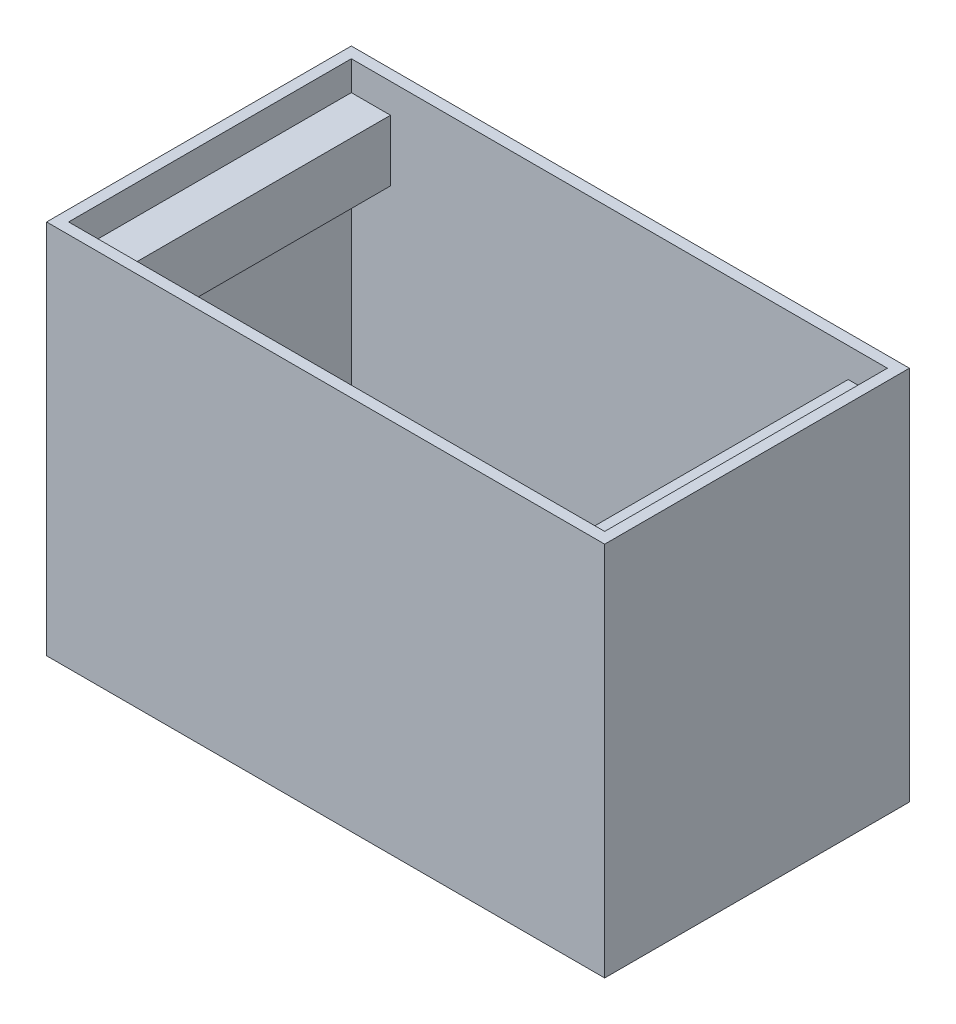
ISO-10303-21;
HEADER;
FILE_DESCRIPTION(('STEP AP214'),'2;1');
FILE_NAME('part.step','',(''),(''),'','','');
FILE_SCHEMA(('AUTOMOTIVE_DESIGN { 1 0 10303 214 1 1 1 1 }'));
ENDSEC;
DATA;
#1=APPLICATION_CONTEXT('core data for automotive mechanical design processes');
#2=APPLICATION_PROTOCOL_DEFINITION('international standard','automotive_design',2000,#1);
#3=PRODUCT_CONTEXT('',#1,'mechanical');
#4=PRODUCT('Part','Part','',(#3));
#5=PRODUCT_RELATED_PRODUCT_CATEGORY('part','',(#4));
#6=PRODUCT_DEFINITION_FORMATION('','',#4);
#7=PRODUCT_DEFINITION_CONTEXT('part definition',#1,'design');
#8=PRODUCT_DEFINITION('design','',#6,#7);
#9=PRODUCT_DEFINITION_SHAPE('','',#8);
#10=(LENGTH_UNIT() NAMED_UNIT(*) SI_UNIT(.MILLI.,.METRE.));
#11=(NAMED_UNIT(*) PLANE_ANGLE_UNIT() SI_UNIT($,.RADIAN.));
#12=(NAMED_UNIT(*) SI_UNIT($,.STERADIAN.) SOLID_ANGLE_UNIT());
#13=UNCERTAINTY_MEASURE_WITH_UNIT(LENGTH_MEASURE(1.E-05),#10,'distance_accuracy_value','');
#14=(GEOMETRIC_REPRESENTATION_CONTEXT(3) GLOBAL_UNCERTAINTY_ASSIGNED_CONTEXT((#13)) GLOBAL_UNIT_ASSIGNED_CONTEXT((#10,
#11,#12)) REPRESENTATION_CONTEXT('',''));
#15=CARTESIAN_POINT('',(0.,0.,0.));
#16=DIRECTION('',(0.,0.,1.));
#17=DIRECTION('',(1.,0.,0.));
#18=AXIS2_PLACEMENT_3D('',#15,#16,#17);
#19=CARTESIAN_POINT('',(219.,298.,115.5));
#20=DIRECTION('',(-1.,0.,0.));
#21=DIRECTION('',(0.,0.,1.));
#22=AXIS2_PLACEMENT_3D('',#19,#20,#21);
#23=PLANE('',#22);
#24=DIRECTION('',(0.,0.,-1.));
#25=VECTOR('',#24,1.);
#26=CARTESIAN_POINT('',(219.,224.,115.5));
#27=LINE('',#26,#25);
#28=CARTESIAN_POINT('',(219.,224.,115.5));
#29=VERTEX_POINT('',#28);
#30=CARTESIAN_POINT('',(219.,224.,-115.5));
#31=VERTEX_POINT('',#30);
#32=EDGE_CURVE('E178',#29,#31,#27,.T.);
#33=ORIENTED_EDGE('',*,*,#32,.T.);
#34=DIRECTION('',(0.,-1.,0.));
#35=VECTOR('',#34,1.);
#36=CARTESIAN_POINT('',(219.,298.,-115.5));
#37=LINE('',#36,#35);
#38=CARTESIAN_POINT('',(219.,0.,-115.5));
#39=VERTEX_POINT('',#38);
#40=EDGE_CURVE('E166',#31,#39,#37,.T.);
#41=ORIENTED_EDGE('',*,*,#40,.T.);
#42=DIRECTION('',(0.,0.,-1.));
#43=VECTOR('',#42,1.);
#44=CARTESIAN_POINT('',(219.,0.,115.5));
#45=LINE('',#44,#43);
#46=CARTESIAN_POINT('',(219.,0.,115.5));
#47=VERTEX_POINT('',#46);
#48=EDGE_CURVE('E213',#47,#39,#45,.T.);
#49=ORIENTED_EDGE('',*,*,#48,.F.);
#50=DIRECTION('',(0.,-1.,0.));
#51=VECTOR('',#50,1.);
#52=CARTESIAN_POINT('',(219.,298.,115.5));
#53=LINE('',#52,#51);
#54=EDGE_CURVE('E223',#29,#47,#53,.T.);
#55=ORIENTED_EDGE('',*,*,#54,.F.);
#56=EDGE_LOOP('',(#33,#41,#49,#55));
#57=FACE_BOUND('',#56,.T.);
#58=ADVANCED_FACE('F43',(#57),#23,.T.);
#59=CARTESIAN_POINT('',(-219.,298.,-115.5));
#60=DIRECTION('',(0.,0.,1.));
#61=DIRECTION('',(1.,0.,0.));
#62=AXIS2_PLACEMENT_3D('',#59,#60,#61);
#63=PLANE('',#62);
#64=DIRECTION('',(1.,0.,0.));
#65=VECTOR('',#64,1.);
#66=CARTESIAN_POINT('',(187.,224.,-115.5));
#67=LINE('',#66,#65);
#68=CARTESIAN_POINT('',(187.,224.,-115.5));
#69=VERTEX_POINT('',#68);
#70=EDGE_CURVE('E65',#69,#31,#67,.T.);
#71=ORIENTED_EDGE('',*,*,#70,.F.);
#72=DIRECTION('',(0.,1.,0.));
#73=VECTOR('',#72,1.);
#74=CARTESIAN_POINT('',(187.,224.,-115.5));
#75=LINE('',#74,#73);
#76=CARTESIAN_POINT('',(187.,274.,-115.5));
#77=VERTEX_POINT('',#76);
#78=EDGE_CURVE('E60',#69,#77,#75,.T.);
#79=ORIENTED_EDGE('',*,*,#78,.T.);
#80=DIRECTION('',(1.,0.,0.));
#81=VECTOR('',#80,1.);
#82=CARTESIAN_POINT('',(187.,274.,-115.5));
#83=LINE('',#82,#81);
#84=CARTESIAN_POINT('',(219.,274.,-115.5));
#85=VERTEX_POINT('',#84);
#86=EDGE_CURVE('E168',#77,#85,#83,.T.);
#87=ORIENTED_EDGE('',*,*,#86,.T.);
#88=CARTESIAN_POINT('',(219.,298.,-115.5));
#89=VERTEX_POINT('',#88);
#90=EDGE_CURVE('E156',#89,#85,#37,.T.);
#91=ORIENTED_EDGE('',*,*,#90,.F.);
#92=DIRECTION('',(-1.,0.,0.));
#93=VECTOR('',#92,1.);
#94=CARTESIAN_POINT('',(-219.,298.,-115.5));
#95=LINE('',#94,#93);
#96=CARTESIAN_POINT('',(-219.,298.,-115.5));
#97=VERTEX_POINT('',#96);
#98=EDGE_CURVE('E215',#89,#97,#95,.T.);
#99=ORIENTED_EDGE('',*,*,#98,.T.);
#100=DIRECTION('',(0.,-1.,0.));
#101=VECTOR('',#100,1.);
#102=CARTESIAN_POINT('',(-219.,298.,-115.5));
#103=LINE('',#102,#101);
#104=CARTESIAN_POINT('',(-219.,274.,-115.5));
#105=VERTEX_POINT('',#104);
#106=EDGE_CURVE('E241',#97,#105,#103,.T.);
#107=ORIENTED_EDGE('',*,*,#106,.T.);
#108=DIRECTION('',(-1.,0.,0.));
#109=VECTOR('',#108,1.);
#110=CARTESIAN_POINT('',(-187.,274.,-115.5));
#111=LINE('',#110,#109);
#112=CARTESIAN_POINT('',(-187.,274.,-115.5));
#113=VERTEX_POINT('',#112);
#114=EDGE_CURVE('E211',#113,#105,#111,.T.);
#115=ORIENTED_EDGE('',*,*,#114,.F.);
#116=DIRECTION('',(0.,1.,0.));
#117=VECTOR('',#116,1.);
#118=CARTESIAN_POINT('',(-187.,224.,-115.5));
#119=LINE('',#118,#117);
#120=CARTESIAN_POINT('',(-187.,224.,-115.5));
#121=VERTEX_POINT('',#120);
#122=EDGE_CURVE('E190',#121,#113,#119,.T.);
#123=ORIENTED_EDGE('',*,*,#122,.F.);
#124=DIRECTION('',(-1.,0.,0.));
#125=VECTOR('',#124,1.);
#126=CARTESIAN_POINT('',(-187.,224.,-115.5));
#127=LINE('',#126,#125);
#128=CARTESIAN_POINT('',(-219.,224.,-115.5));
#129=VERTEX_POINT('',#128);
#130=EDGE_CURVE('E201',#121,#129,#127,.T.);
#131=ORIENTED_EDGE('',*,*,#130,.T.);
#132=CARTESIAN_POINT('',(-219.,0.,-115.5));
#133=VERTEX_POINT('',#132);
#134=EDGE_CURVE('E240',#129,#133,#103,.T.);
#135=ORIENTED_EDGE('',*,*,#134,.T.);
#136=DIRECTION('',(-1.,0.,0.));
#137=VECTOR('',#136,1.);
#138=CARTESIAN_POINT('',(-219.,0.,-115.5));
#139=LINE('',#138,#137);
#140=EDGE_CURVE('E226',#39,#133,#139,.T.);
#141=ORIENTED_EDGE('',*,*,#140,.F.);
#142=ORIENTED_EDGE('',*,*,#40,.F.);
#143=EDGE_LOOP('',(#71,#79,#87,#91,#99,#107,#115,#123,#131,#135,#141,#142));
#144=FACE_BOUND('',#143,.T.);
#145=ADVANCED_FACE('F169',(#144),#63,.T.);
#146=CARTESIAN_POINT('',(-219.,298.,115.5));
#147=DIRECTION('',(1.,0.,0.));
#148=DIRECTION('',(0.,0.,-1.));
#149=AXIS2_PLACEMENT_3D('',#146,#147,#148);
#150=PLANE('',#149);
#151=DIRECTION('',(0.,-1.,0.));
#152=VECTOR('',#151,1.);
#153=CARTESIAN_POINT('',(-219.,298.,115.5));
#154=LINE('',#153,#152);
#155=CARTESIAN_POINT('',(-219.,298.,115.5));
#156=VERTEX_POINT('',#155);
#157=CARTESIAN_POINT('',(-219.,274.,115.5));
#158=VERTEX_POINT('',#157);
#159=EDGE_CURVE('E237',#156,#158,#154,.T.);
#160=ORIENTED_EDGE('',*,*,#159,.T.);
#161=DIRECTION('',(0.,0.,1.));
#162=VECTOR('',#161,1.);
#163=CARTESIAN_POINT('',(-219.,274.,115.5));
#164=LINE('',#163,#162);
#165=EDGE_CURVE('E189',#105,#158,#164,.T.);
#166=ORIENTED_EDGE('',*,*,#165,.F.);
#167=ORIENTED_EDGE('',*,*,#106,.F.);
#168=DIRECTION('',(0.,0.,1.));
#169=VECTOR('',#168,1.);
#170=CARTESIAN_POINT('',(-219.,298.,115.5));
#171=LINE('',#170,#169);
#172=EDGE_CURVE('E218',#97,#156,#171,.T.);
#173=ORIENTED_EDGE('',*,*,#172,.T.);
#174=EDGE_LOOP('',(#160,#166,#167,#173));
#175=FACE_BOUND('',#174,.T.);
#176=ADVANCED_FACE('F298',(#175),#150,.T.);
#177=ORIENTED_EDGE('',*,*,#134,.F.);
#178=DIRECTION('',(0.,0.,-1.));
#179=VECTOR('',#178,1.);
#180=CARTESIAN_POINT('',(-219.,224.,115.5));
#181=LINE('',#180,#179);
#182=CARTESIAN_POINT('',(-219.,224.,115.5));
#183=VERTEX_POINT('',#182);
#184=EDGE_CURVE('E194',#183,#129,#181,.T.);
#185=ORIENTED_EDGE('',*,*,#184,.F.);
#186=CARTESIAN_POINT('',(-219.,0.,115.5));
#187=VERTEX_POINT('',#186);
#188=EDGE_CURVE('E236',#183,#187,#154,.T.);
#189=ORIENTED_EDGE('',*,*,#188,.T.);
#190=DIRECTION('',(0.,0.,1.));
#191=VECTOR('',#190,1.);
#192=CARTESIAN_POINT('',(-219.,0.,115.5));
#193=LINE('',#192,#191);
#194=EDGE_CURVE('E229',#133,#187,#193,.T.);
#195=ORIENTED_EDGE('',*,*,#194,.F.);
#196=EDGE_LOOP('',(#177,#185,#189,#195));
#197=FACE_BOUND('',#196,.T.);
#198=ADVANCED_FACE('F324',(#197),#150,.T.);
#199=CARTESIAN_POINT('',(-219.,298.,115.5));
#200=DIRECTION('',(0.,0.,-1.));
#201=DIRECTION('',(-1.,0.,0.));
#202=AXIS2_PLACEMENT_3D('',#199,#200,#201);
#203=PLANE('',#202);
#204=DIRECTION('',(1.,0.,0.));
#205=VECTOR('',#204,1.);
#206=CARTESIAN_POINT('',(187.,224.,115.5));
#207=LINE('',#206,#205);
#208=CARTESIAN_POINT('',(187.,224.,115.5));
#209=VERTEX_POINT('',#208);
#210=EDGE_CURVE('E186',#209,#29,#207,.T.);
#211=ORIENTED_EDGE('',*,*,#210,.T.);
#212=ORIENTED_EDGE('',*,*,#54,.T.);
#213=DIRECTION('',(1.,0.,0.));
#214=VECTOR('',#213,1.);
#215=CARTESIAN_POINT('',(-219.,0.,115.5));
#216=LINE('',#215,#214);
#217=EDGE_CURVE('E216',#187,#47,#216,.T.);
#218=ORIENTED_EDGE('',*,*,#217,.F.);
#219=ORIENTED_EDGE('',*,*,#188,.F.);
#220=DIRECTION('',(-1.,0.,0.));
#221=VECTOR('',#220,1.);
#222=CARTESIAN_POINT('',(-187.,224.,115.5));
#223=LINE('',#222,#221);
#224=CARTESIAN_POINT('',(-187.,224.,115.5));
#225=VERTEX_POINT('',#224);
#226=EDGE_CURVE('E206',#225,#183,#223,.T.);
#227=ORIENTED_EDGE('',*,*,#226,.F.);
#228=DIRECTION('',(0.,-1.,0.));
#229=VECTOR('',#228,1.);
#230=CARTESIAN_POINT('',(-187.,224.,115.5));
#231=LINE('',#230,#229);
#232=CARTESIAN_POINT('',(-187.,274.,115.5));
#233=VERTEX_POINT('',#232);
#234=EDGE_CURVE('E197',#233,#225,#231,.T.);
#235=ORIENTED_EDGE('',*,*,#234,.F.);
#236=DIRECTION('',(-1.,0.,0.));
#237=VECTOR('',#236,1.);
#238=CARTESIAN_POINT('',(-187.,274.,115.5));
#239=LINE('',#238,#237);
#240=EDGE_CURVE('E208',#233,#158,#239,.T.);
#241=ORIENTED_EDGE('',*,*,#240,.T.);
#242=ORIENTED_EDGE('',*,*,#159,.F.);
#243=DIRECTION('',(1.,0.,0.));
#244=VECTOR('',#243,1.);
#245=CARTESIAN_POINT('',(-219.,298.,115.5));
#246=LINE('',#245,#244);
#247=CARTESIAN_POINT('',(219.,298.,115.5));
#248=VERTEX_POINT('',#247);
#249=EDGE_CURVE('E221',#156,#248,#246,.T.);
#250=ORIENTED_EDGE('',*,*,#249,.T.);
#251=CARTESIAN_POINT('',(219.,274.,115.5));
#252=VERTEX_POINT('',#251);
#253=EDGE_CURVE('E234',#248,#252,#53,.T.);
#254=ORIENTED_EDGE('',*,*,#253,.T.);
#255=DIRECTION('',(1.,0.,0.));
#256=VECTOR('',#255,1.);
#257=CARTESIAN_POINT('',(187.,274.,115.5));
#258=LINE('',#257,#256);
#259=CARTESIAN_POINT('',(187.,274.,115.5));
#260=VERTEX_POINT('',#259);
#261=EDGE_CURVE('E173',#260,#252,#258,.T.);
#262=ORIENTED_EDGE('',*,*,#261,.F.);
#263=DIRECTION('',(0.,-1.,0.));
#264=VECTOR('',#263,1.);
#265=CARTESIAN_POINT('',(187.,224.,115.5));
#266=LINE('',#265,#264);
#267=EDGE_CURVE('E368',#260,#209,#266,.T.);
#268=ORIENTED_EDGE('',*,*,#267,.T.);
#269=EDGE_LOOP('',(#211,#212,#218,#219,#227,#235,#241,#242,#250,#254,#262,#268));
#270=FACE_BOUND('',#269,.T.);
#271=ADVANCED_FACE('F318',(#270),#203,.T.);
#272=CARTESIAN_POINT('',(-228.,-8.99999999999993,0.));
#273=DIRECTION('',(1.,0.,0.));
#274=DIRECTION('',(0.,0.,-1.));
#275=AXIS2_PLACEMENT_3D('',#272,#273,#274);
#276=PLANE('',#275);
#277=DIRECTION('',(0.,1.,0.));
#278=VECTOR('',#277,1.);
#279=CARTESIAN_POINT('',(-228.,-8.99999999999993,124.5));
#280=LINE('',#279,#278);
#281=CARTESIAN_POINT('',(-228.,-8.99999999999993,124.5));
#282=VERTEX_POINT('',#281);
#283=CARTESIAN_POINT('',(-228.,298.,124.5));
#284=VERTEX_POINT('',#283);
#285=EDGE_CURVE('E47',#282,#284,#280,.T.);
#286=ORIENTED_EDGE('',*,*,#285,.T.);
#287=DIRECTION('',(0.,0.,1.));
#288=VECTOR('',#287,1.);
#289=CARTESIAN_POINT('',(-228.,298.,124.5));
#290=LINE('',#289,#288);
#291=CARTESIAN_POINT('',(-228.,298.,-124.5));
#292=VERTEX_POINT('',#291);
#293=EDGE_CURVE('E252',#292,#284,#290,.T.);
#294=ORIENTED_EDGE('',*,*,#293,.F.);
#295=DIRECTION('',(0.,1.,0.));
#296=VECTOR('',#295,1.);
#297=CARTESIAN_POINT('',(-228.,-8.99999999999993,-124.5));
#298=LINE('',#297,#296);
#299=CARTESIAN_POINT('',(-228.,-8.99999999999993,-124.5));
#300=VERTEX_POINT('',#299);
#301=EDGE_CURVE('E11',#300,#292,#298,.T.);
#302=ORIENTED_EDGE('',*,*,#301,.F.);
#303=DIRECTION('',(0.,0.,-1.));
#304=VECTOR('',#303,1.);
#305=CARTESIAN_POINT('',(-228.,-8.99999999999993,0.));
#306=LINE('',#305,#304);
#307=EDGE_CURVE('E255',#282,#300,#306,.T.);
#308=ORIENTED_EDGE('',*,*,#307,.F.);
#309=EDGE_LOOP('',(#286,#294,#302,#308));
#310=FACE_BOUND('',#309,.T.);
#311=ADVANCED_FACE('F45',(#310),#276,.F.);
#312=CARTESIAN_POINT('',(0.,-8.99999999999993,-124.5));
#313=DIRECTION('',(0.,0.,1.));
#314=DIRECTION('',(1.,0.,0.));
#315=AXIS2_PLACEMENT_3D('',#312,#313,#314);
#316=PLANE('',#315);
#317=ORIENTED_EDGE('',*,*,#301,.T.);
#318=DIRECTION('',(-1.,0.,0.));
#319=VECTOR('',#318,1.);
#320=CARTESIAN_POINT('',(-228.,298.,-124.5));
#321=LINE('',#320,#319);
#322=CARTESIAN_POINT('',(228.,298.,-124.5));
#323=VERTEX_POINT('',#322);
#324=EDGE_CURVE('E249',#323,#292,#321,.T.);
#325=ORIENTED_EDGE('',*,*,#324,.F.);
#326=DIRECTION('',(0.,1.,0.));
#327=VECTOR('',#326,1.);
#328=CARTESIAN_POINT('',(228.,-8.99999999999993,-124.5));
#329=LINE('',#328,#327);
#330=CARTESIAN_POINT('',(228.,-8.99999999999993,-124.5));
#331=VERTEX_POINT('',#330);
#332=EDGE_CURVE('E52',#331,#323,#329,.T.);
#333=ORIENTED_EDGE('',*,*,#332,.F.);
#334=DIRECTION('',(1.,0.,0.));
#335=VECTOR('',#334,1.);
#336=CARTESIAN_POINT('',(0.,-8.99999999999993,-124.5));
#337=LINE('',#336,#335);
#338=EDGE_CURVE('E264',#300,#331,#337,.T.);
#339=ORIENTED_EDGE('',*,*,#338,.F.);
#340=EDGE_LOOP('',(#317,#325,#333,#339));
#341=FACE_BOUND('',#340,.T.);
#342=ADVANCED_FACE('F289',(#341),#316,.F.);
#343=CARTESIAN_POINT('',(228.,-8.99999999999993,0.));
#344=DIRECTION('',(1.,0.,0.));
#345=DIRECTION('',(0.,0.,-1.));
#346=AXIS2_PLACEMENT_3D('',#343,#344,#345);
#347=PLANE('',#346);
#348=ORIENTED_EDGE('',*,*,#332,.T.);
#349=DIRECTION('',(0.,0.,-1.));
#350=VECTOR('',#349,1.);
#351=CARTESIAN_POINT('',(228.,298.,124.5));
#352=LINE('',#351,#350);
#353=CARTESIAN_POINT('',(228.,298.,124.5));
#354=VERTEX_POINT('',#353);
#355=EDGE_CURVE('E246',#354,#323,#352,.T.);
#356=ORIENTED_EDGE('',*,*,#355,.F.);
#357=DIRECTION('',(0.,1.,0.));
#358=VECTOR('',#357,1.);
#359=CARTESIAN_POINT('',(228.,-8.99999999999993,124.5));
#360=LINE('',#359,#358);
#361=CARTESIAN_POINT('',(228.,-8.99999999999993,124.5));
#362=VERTEX_POINT('',#361);
#363=EDGE_CURVE('E266',#362,#354,#360,.T.);
#364=ORIENTED_EDGE('',*,*,#363,.F.);
#365=DIRECTION('',(0.,0.,-1.));
#366=VECTOR('',#365,1.);
#367=CARTESIAN_POINT('',(228.,-8.99999999999993,0.));
#368=LINE('',#367,#366);
#369=EDGE_CURVE('E261',#362,#331,#368,.T.);
#370=ORIENTED_EDGE('',*,*,#369,.T.);
#371=EDGE_LOOP('',(#348,#356,#364,#370));
#372=FACE_BOUND('',#371,.T.);
#373=ADVANCED_FACE('F282',(#372),#347,.T.);
#374=CARTESIAN_POINT('',(0.,-8.99999999999993,124.5));
#375=DIRECTION('',(0.,0.,1.));
#376=DIRECTION('',(1.,0.,0.));
#377=AXIS2_PLACEMENT_3D('',#374,#375,#376);
#378=PLANE('',#377);
#379=ORIENTED_EDGE('',*,*,#363,.T.);
#380=DIRECTION('',(1.,0.,0.));
#381=VECTOR('',#380,1.);
#382=CARTESIAN_POINT('',(-228.,298.,124.5));
#383=LINE('',#382,#381);
#384=EDGE_CURVE('E165',#284,#354,#383,.T.);
#385=ORIENTED_EDGE('',*,*,#384,.F.);
#386=ORIENTED_EDGE('',*,*,#285,.F.);
#387=DIRECTION('',(1.,0.,0.));
#388=VECTOR('',#387,1.);
#389=CARTESIAN_POINT('',(0.,-8.99999999999993,124.5));
#390=LINE('',#389,#388);
#391=EDGE_CURVE('E258',#282,#362,#390,.T.);
#392=ORIENTED_EDGE('',*,*,#391,.T.);
#393=EDGE_LOOP('',(#379,#385,#386,#392));
#394=FACE_BOUND('',#393,.T.);
#395=ADVANCED_FACE('F279',(#394),#378,.T.);
#396=CARTESIAN_POINT('',(0.,-8.99999999999993,0.));
#397=DIRECTION('',(0.,1.,0.));
#398=DIRECTION('',(0.,0.,1.));
#399=AXIS2_PLACEMENT_3D('',#396,#397,#398);
#400=PLANE('',#399);
#401=ORIENTED_EDGE('',*,*,#307,.T.);
#402=ORIENTED_EDGE('',*,*,#338,.T.);
#403=ORIENTED_EDGE('',*,*,#369,.F.);
#404=ORIENTED_EDGE('',*,*,#391,.F.);
#405=EDGE_LOOP('',(#401,#402,#403,#404));
#406=FACE_BOUND('',#405,.T.);
#407=ADVANCED_FACE('F281',(#406),#400,.F.);
#408=CARTESIAN_POINT('',(0.,298.,0.));
#409=DIRECTION('',(0.,1.,0.));
#410=DIRECTION('',(0.,0.,1.));
#411=AXIS2_PLACEMENT_3D('',#408,#409,#410);
#412=PLANE('',#411);
#413=ORIENTED_EDGE('',*,*,#384,.T.);
#414=ORIENTED_EDGE('',*,*,#355,.T.);
#415=ORIENTED_EDGE('',*,*,#324,.T.);
#416=ORIENTED_EDGE('',*,*,#293,.T.);
#417=EDGE_LOOP('',(#413,#414,#415,#416));
#418=FACE_BOUND('',#417,.T.);
#419=ORIENTED_EDGE('',*,*,#98,.F.);
#420=DIRECTION('',(0.,0.,-1.));
#421=VECTOR('',#420,1.);
#422=CARTESIAN_POINT('',(219.,298.,115.5));
#423=LINE('',#422,#421);
#424=EDGE_CURVE('E163',#248,#89,#423,.T.);
#425=ORIENTED_EDGE('',*,*,#424,.F.);
#426=ORIENTED_EDGE('',*,*,#249,.F.);
#427=ORIENTED_EDGE('',*,*,#172,.F.);
#428=EDGE_LOOP('',(#419,#425,#426,#427));
#429=FACE_BOUND('',#428,.T.);
#430=ADVANCED_FACE('F276',(#418,#429),#412,.T.);
#431=DIRECTION('',(0.,0.,1.));
#432=VECTOR('',#431,1.);
#433=CARTESIAN_POINT('',(219.,274.,115.5));
#434=LINE('',#433,#432);
#435=EDGE_CURVE('E160',#85,#252,#434,.T.);
#436=ORIENTED_EDGE('',*,*,#435,.T.);
#437=ORIENTED_EDGE('',*,*,#253,.F.);
#438=ORIENTED_EDGE('',*,*,#424,.T.);
#439=ORIENTED_EDGE('',*,*,#90,.T.);
#440=EDGE_LOOP('',(#436,#437,#438,#439));
#441=FACE_BOUND('',#440,.T.);
#442=ADVANCED_FACE('F157',(#441),#23,.T.);
#443=CARTESIAN_POINT('',(0.,0.,0.));
#444=DIRECTION('',(0.,1.,0.));
#445=DIRECTION('',(0.,0.,1.));
#446=AXIS2_PLACEMENT_3D('',#443,#444,#445);
#447=PLANE('',#446);
#448=ORIENTED_EDGE('',*,*,#48,.T.);
#449=ORIENTED_EDGE('',*,*,#140,.T.);
#450=ORIENTED_EDGE('',*,*,#194,.T.);
#451=ORIENTED_EDGE('',*,*,#217,.T.);
#452=EDGE_LOOP('',(#448,#449,#450,#451));
#453=FACE_BOUND('',#452,.T.);
#454=ADVANCED_FACE('F302',(#453),#447,.T.);
#455=CARTESIAN_POINT('',(-187.,274.,115.5));
#456=DIRECTION('',(0.,-1.,0.));
#457=DIRECTION('',(0.,0.,-1.));
#458=AXIS2_PLACEMENT_3D('',#455,#456,#457);
#459=PLANE('',#458);
#460=ORIENTED_EDGE('',*,*,#165,.T.);
#461=ORIENTED_EDGE('',*,*,#240,.F.);
#462=DIRECTION('',(0.,0.,1.));
#463=VECTOR('',#462,1.);
#464=CARTESIAN_POINT('',(-187.,274.,115.5));
#465=LINE('',#464,#463);
#466=EDGE_CURVE('E193',#113,#233,#465,.T.);
#467=ORIENTED_EDGE('',*,*,#466,.F.);
#468=ORIENTED_EDGE('',*,*,#114,.T.);
#469=EDGE_LOOP('',(#460,#461,#467,#468));
#470=FACE_BOUND('',#469,.T.);
#471=ADVANCED_FACE('F307',(#470),#459,.F.);
#472=CARTESIAN_POINT('',(-187.,224.,115.5));
#473=DIRECTION('',(0.,1.,0.));
#474=DIRECTION('',(0.,0.,1.));
#475=AXIS2_PLACEMENT_3D('',#472,#473,#474);
#476=PLANE('',#475);
#477=ORIENTED_EDGE('',*,*,#184,.T.);
#478=ORIENTED_EDGE('',*,*,#130,.F.);
#479=DIRECTION('',(0.,0.,-1.));
#480=VECTOR('',#479,1.);
#481=CARTESIAN_POINT('',(-187.,224.,115.5));
#482=LINE('',#481,#480);
#483=EDGE_CURVE('E199',#225,#121,#482,.T.);
#484=ORIENTED_EDGE('',*,*,#483,.F.);
#485=ORIENTED_EDGE('',*,*,#226,.T.);
#486=EDGE_LOOP('',(#477,#478,#484,#485));
#487=FACE_BOUND('',#486,.T.);
#488=ADVANCED_FACE('F382',(#487),#476,.F.);
#489=CARTESIAN_POINT('',(-187.,0.,0.));
#490=DIRECTION('',(-1.,0.,0.));
#491=DIRECTION('',(0.,0.,1.));
#492=AXIS2_PLACEMENT_3D('',#489,#490,#491);
#493=PLANE('',#492);
#494=ORIENTED_EDGE('',*,*,#122,.T.);
#495=ORIENTED_EDGE('',*,*,#466,.T.);
#496=ORIENTED_EDGE('',*,*,#234,.T.);
#497=ORIENTED_EDGE('',*,*,#483,.T.);
#498=EDGE_LOOP('',(#494,#495,#496,#497));
#499=FACE_BOUND('',#498,.T.);
#500=ADVANCED_FACE('F346',(#499),#493,.F.);
#501=CARTESIAN_POINT('',(187.,224.,115.5));
#502=DIRECTION('',(0.,-1.,0.));
#503=DIRECTION('',(0.,0.,-1.));
#504=AXIS2_PLACEMENT_3D('',#501,#502,#503);
#505=PLANE('',#504);
#506=ORIENTED_EDGE('',*,*,#32,.F.);
#507=ORIENTED_EDGE('',*,*,#210,.F.);
#508=DIRECTION('',(0.,0.,-1.));
#509=VECTOR('',#508,1.);
#510=CARTESIAN_POINT('',(187.,224.,115.5));
#511=LINE('',#510,#509);
#512=EDGE_CURVE('E180',#209,#69,#511,.T.);
#513=ORIENTED_EDGE('',*,*,#512,.T.);
#514=ORIENTED_EDGE('',*,*,#70,.T.);
#515=EDGE_LOOP('',(#506,#507,#513,#514));
#516=FACE_BOUND('',#515,.T.);
#517=ADVANCED_FACE('F363',(#516),#505,.T.);
#518=CARTESIAN_POINT('',(187.,274.,115.5));
#519=DIRECTION('',(0.,1.,0.));
#520=DIRECTION('',(0.,0.,1.));
#521=AXIS2_PLACEMENT_3D('',#518,#519,#520);
#522=PLANE('',#521);
#523=ORIENTED_EDGE('',*,*,#435,.F.);
#524=ORIENTED_EDGE('',*,*,#86,.F.);
#525=DIRECTION('',(0.,0.,1.));
#526=VECTOR('',#525,1.);
#527=CARTESIAN_POINT('',(187.,274.,115.5));
#528=LINE('',#527,#526);
#529=EDGE_CURVE('E174',#77,#260,#528,.T.);
#530=ORIENTED_EDGE('',*,*,#529,.T.);
#531=ORIENTED_EDGE('',*,*,#261,.T.);
#532=EDGE_LOOP('',(#523,#524,#530,#531));
#533=FACE_BOUND('',#532,.T.);
#534=ADVANCED_FACE('F177',(#533),#522,.T.);
#535=CARTESIAN_POINT('',(187.,0.,0.));
#536=DIRECTION('',(1.,0.,0.));
#537=DIRECTION('',(0.,0.,1.));
#538=AXIS2_PLACEMENT_3D('',#535,#536,#537);
#539=PLANE('',#538);
#540=ORIENTED_EDGE('',*,*,#78,.F.);
#541=ORIENTED_EDGE('',*,*,#512,.F.);
#542=ORIENTED_EDGE('',*,*,#267,.F.);
#543=ORIENTED_EDGE('',*,*,#529,.F.);
#544=EDGE_LOOP('',(#540,#541,#542,#543));
#545=FACE_BOUND('',#544,.T.);
#546=ADVANCED_FACE('F371',(#545),#539,.F.);
#547=CLOSED_SHELL('',(#58,#145,#176,#198,#271,#311,#342,#373,#395,#407,#430,#442,#454,#471,#488,
#500,#517,#534,#546));
#548=MANIFOLD_SOLID_BREP('B2',#547);
#549=ADVANCED_BREP_SHAPE_REPRESENTATION('',(#18,#548),#14);
#550=SHAPE_DEFINITION_REPRESENTATION(#9,#549);
ENDSEC;
END-ISO-10303-21;
